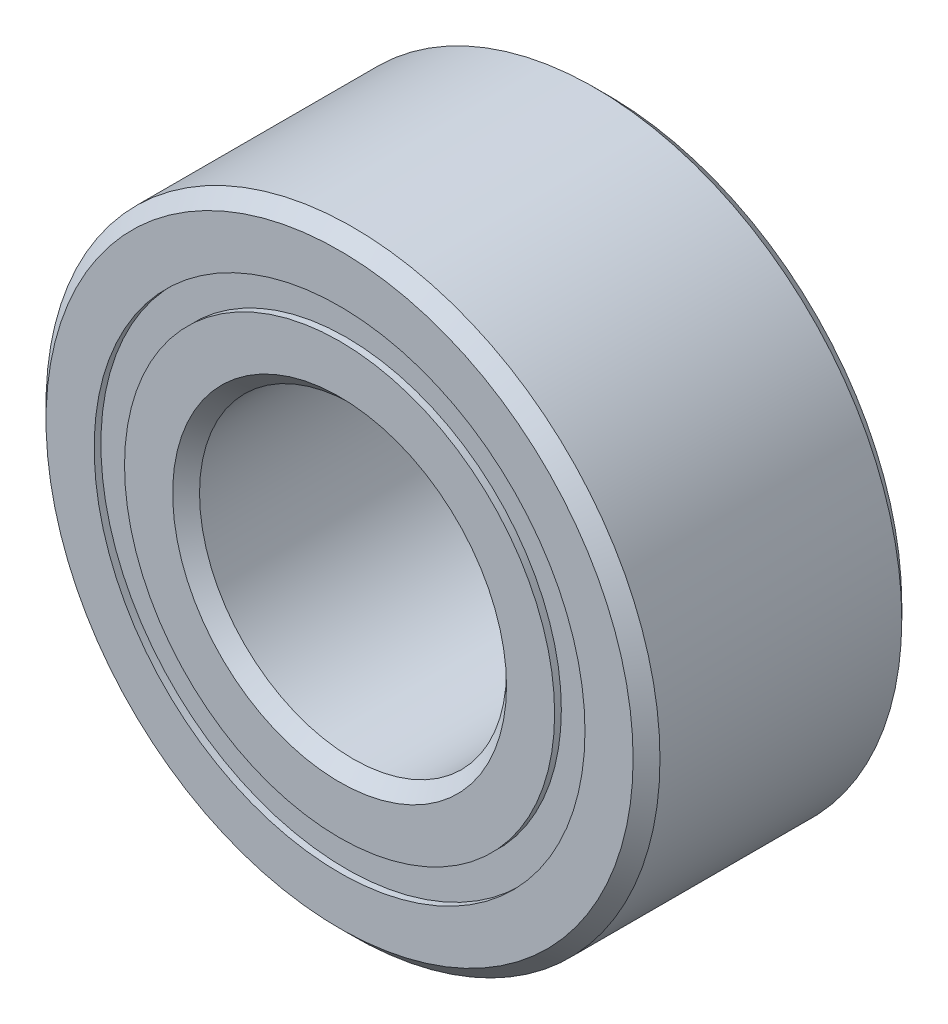
ISO-10303-21;
HEADER;
FILE_DESCRIPTION(('STEP AP214'),'2;1');
FILE_NAME('part.step','',(''),(''),'','','');
FILE_SCHEMA(('AUTOMOTIVE_DESIGN { 1 0 10303 214 1 1 1 1 }'));
ENDSEC;
DATA;
#1=APPLICATION_CONTEXT('core data for automotive mechanical design processes');
#2=APPLICATION_PROTOCOL_DEFINITION('international standard','automotive_design',2000,#1);
#3=PRODUCT_CONTEXT('',#1,'mechanical');
#4=PRODUCT('Part','Part','',(#3));
#5=PRODUCT_RELATED_PRODUCT_CATEGORY('part','',(#4));
#6=PRODUCT_DEFINITION_FORMATION('','',#4);
#7=PRODUCT_DEFINITION_CONTEXT('part definition',#1,'design');
#8=PRODUCT_DEFINITION('design','',#6,#7);
#9=PRODUCT_DEFINITION_SHAPE('','',#8);
#10=(LENGTH_UNIT() NAMED_UNIT(*) SI_UNIT(.MILLI.,.METRE.));
#11=(NAMED_UNIT(*) PLANE_ANGLE_UNIT() SI_UNIT($,.RADIAN.));
#12=(NAMED_UNIT(*) SI_UNIT($,.STERADIAN.) SOLID_ANGLE_UNIT());
#13=UNCERTAINTY_MEASURE_WITH_UNIT(LENGTH_MEASURE(1.E-05),#10,'distance_accuracy_value','');
#14=(GEOMETRIC_REPRESENTATION_CONTEXT(3) GLOBAL_UNCERTAINTY_ASSIGNED_CONTEXT((#13)) GLOBAL_UNIT_ASSIGNED_CONTEXT((#10,
#11,#12)) REPRESENTATION_CONTEXT('',''));
#15=CARTESIAN_POINT('',(0.,0.,0.));
#16=DIRECTION('',(0.,0.,1.));
#17=DIRECTION('',(1.,0.,0.));
#18=AXIS2_PLACEMENT_3D('',#15,#16,#17);
#19=CARTESIAN_POINT('',(0.,2.53822758241758,-1.319911));
#20=DIRECTION('',(0.,0.,1.));
#21=DIRECTION('',(1.,0.,0.));
#22=AXIS2_PLACEMENT_3D('',#19,#20,#21);
#23=PLANE('',#22);
#24=CARTESIAN_POINT('',(0.,0.,-1.319911));
#25=DIRECTION('',(0.,0.,1.));
#26=DIRECTION('',(1.,0.,0.));
#27=AXIS2_PLACEMENT_3D('',#24,#25,#26);
#28=CIRCLE('',#27,2.53822758241758);
#29=CARTESIAN_POINT('',(2.53822758241758,0.,-1.319911));
#30=VERTEX_POINT('',#29);
#31=EDGE_CURVE('E56',#30,#30,#28,.T.);
#32=ORIENTED_EDGE('',*,*,#31,.F.);
#33=EDGE_LOOP('',(#32));
#34=FACE_BOUND('',#33,.T.);
#35=CARTESIAN_POINT('',(0.,0.,-1.319911));
#36=DIRECTION('',(0.,0.,1.));
#37=DIRECTION('',(1.,0.,0.));
#38=AXIS2_PLACEMENT_3D('',#35,#36,#37);
#39=CIRCLE('',#38,2.22427241758242);
#40=CARTESIAN_POINT('',(2.22427241758242,0.,-1.319911));
#41=VERTEX_POINT('',#40);
#42=EDGE_CURVE('E11',#41,#41,#39,.T.);
#43=ORIENTED_EDGE('',*,*,#42,.T.);
#44=EDGE_LOOP('',(#43));
#45=FACE_BOUND('',#44,.T.);
#46=ADVANCED_FACE('F42',(#34,#45),#23,.F.);
#47=CARTESIAN_POINT('',(0.,0.,1.38938));
#48=DIRECTION('',(0.,0.,1.));
#49=DIRECTION('',(1.,0.,0.));
#50=AXIS2_PLACEMENT_3D('',#47,#48,#49);
#51=CYLINDRICAL_SURFACE('',#50,2.22427241758242);
#52=ORIENTED_EDGE('',*,*,#42,.F.);
#53=EDGE_LOOP('',(#52));
#54=FACE_BOUND('',#53,.T.);
#55=CARTESIAN_POINT('',(0.,0.,-0.63714280646575));
#56=DIRECTION('',(0.,0.,1.));
#57=DIRECTION('',(1.,0.,0.));
#58=AXIS2_PLACEMENT_3D('',#55,#56,#57);
#59=CIRCLE('',#58,2.22427241758242);
#60=CARTESIAN_POINT('',(2.22427241758242,0.,-0.63714280646575));
#61=VERTEX_POINT('',#60);
#62=EDGE_CURVE('E48',#61,#61,#59,.T.);
#63=ORIENTED_EDGE('',*,*,#62,.T.);
#64=EDGE_LOOP('',(#63));
#65=FACE_BOUND('',#64,.T.);
#66=ADVANCED_FACE('F65',(#54,#65),#51,.F.);
#67=CARTESIAN_POINT('',(0.,2.53822758241758,-0.63714280646575));
#68=DIRECTION('',(0.,0.,-1.));
#69=DIRECTION('',(-1.,0.,0.));
#70=AXIS2_PLACEMENT_3D('',#67,#68,#69);
#71=PLANE('',#70);
#72=ORIENTED_EDGE('',*,*,#62,.F.);
#73=EDGE_LOOP('',(#72));
#74=FACE_BOUND('',#73,.T.);
#75=CARTESIAN_POINT('',(0.,0.,-0.63714280646575));
#76=DIRECTION('',(0.,0.,1.));
#77=DIRECTION('',(1.,0.,0.));
#78=AXIS2_PLACEMENT_3D('',#75,#76,#77);
#79=CIRCLE('',#78,2.53822758241758);
#80=CARTESIAN_POINT('',(2.53822758241758,0.,-0.63714280646575));
#81=VERTEX_POINT('',#80);
#82=EDGE_CURVE('E52',#81,#81,#79,.T.);
#83=ORIENTED_EDGE('',*,*,#82,.T.);
#84=EDGE_LOOP('',(#83));
#85=FACE_BOUND('',#84,.T.);
#86=ADVANCED_FACE('F69',(#74,#85),#71,.F.);
#87=CARTESIAN_POINT('',(0.,0.,1.38938));
#88=DIRECTION('',(0.,0.,1.));
#89=DIRECTION('',(1.,0.,0.));
#90=AXIS2_PLACEMENT_3D('',#87,#88,#89);
#91=CYLINDRICAL_SURFACE('',#90,2.53822758241758);
#92=ORIENTED_EDGE('',*,*,#82,.F.);
#93=EDGE_LOOP('',(#92));
#94=FACE_BOUND('',#93,.T.);
#95=ORIENTED_EDGE('',*,*,#31,.T.);
#96=EDGE_LOOP('',(#95));
#97=FACE_BOUND('',#96,.T.);
#98=ADVANCED_FACE('F62',(#94,#97),#91,.T.);
#99=CLOSED_SHELL('',(#46,#66,#86,#98));
#100=MANIFOLD_SOLID_BREP('B2',#99);
#101=CARTESIAN_POINT('',(0.,2.53822758241758,1.319911));
#102=DIRECTION('',(0.,0.,-1.));
#103=DIRECTION('',(-1.,0.,0.));
#104=AXIS2_PLACEMENT_3D('',#101,#102,#103);
#105=PLANE('',#104);
#106=CARTESIAN_POINT('',(0.,0.,1.319911));
#107=DIRECTION('',(0.,0.,1.));
#108=DIRECTION('',(1.,0.,0.));
#109=AXIS2_PLACEMENT_3D('',#106,#107,#108);
#110=CIRCLE('',#109,2.22427241758242);
#111=CARTESIAN_POINT('',(2.22427241758242,0.,1.319911));
#112=VERTEX_POINT('',#111);
#113=EDGE_CURVE('E41',#112,#112,#110,.T.);
#114=ORIENTED_EDGE('',*,*,#113,.F.);
#115=EDGE_LOOP('',(#114));
#116=FACE_BOUND('',#115,.T.);
#117=CARTESIAN_POINT('',(0.,0.,1.319911));
#118=DIRECTION('',(0.,0.,1.));
#119=DIRECTION('',(1.,0.,0.));
#120=AXIS2_PLACEMENT_3D('',#117,#118,#119);
#121=CIRCLE('',#120,2.53822758241758);
#122=CARTESIAN_POINT('',(2.53822758241758,0.,1.319911));
#123=VERTEX_POINT('',#122);
#124=EDGE_CURVE('E124',#123,#123,#121,.T.);
#125=ORIENTED_EDGE('',*,*,#124,.T.);
#126=EDGE_LOOP('',(#125));
#127=FACE_BOUND('',#126,.T.);
#128=ADVANCED_FACE('F110',(#116,#127),#105,.F.);
#129=CARTESIAN_POINT('',(0.,0.,1.38938));
#130=DIRECTION('',(0.,0.,1.));
#131=DIRECTION('',(1.,0.,0.));
#132=AXIS2_PLACEMENT_3D('',#129,#130,#131);
#133=CYLINDRICAL_SURFACE('',#132,2.22427241758242);
#134=CARTESIAN_POINT('',(0.,0.,0.637142806465749));
#135=DIRECTION('',(0.,0.,1.));
#136=DIRECTION('',(1.,0.,0.));
#137=AXIS2_PLACEMENT_3D('',#134,#135,#136);
#138=CIRCLE('',#137,2.22427241758242);
#139=CARTESIAN_POINT('',(2.22427241758242,0.,0.637142806465749));
#140=VERTEX_POINT('',#139);
#141=EDGE_CURVE('E116',#140,#140,#138,.T.);
#142=ORIENTED_EDGE('',*,*,#141,.F.);
#143=EDGE_LOOP('',(#142));
#144=FACE_BOUND('',#143,.T.);
#145=ORIENTED_EDGE('',*,*,#113,.T.);
#146=EDGE_LOOP('',(#145));
#147=FACE_BOUND('',#146,.T.);
#148=ADVANCED_FACE('F139',(#144,#147),#133,.F.);
#149=CARTESIAN_POINT('',(0.,2.53822758241758,0.637142806465749));
#150=DIRECTION('',(0.,0.,1.));
#151=DIRECTION('',(1.,0.,0.));
#152=AXIS2_PLACEMENT_3D('',#149,#150,#151);
#153=PLANE('',#152);
#154=CARTESIAN_POINT('',(0.,0.,0.637142806465749));
#155=DIRECTION('',(0.,0.,1.));
#156=DIRECTION('',(1.,0.,0.));
#157=AXIS2_PLACEMENT_3D('',#154,#155,#156);
#158=CIRCLE('',#157,2.53822758241758);
#159=CARTESIAN_POINT('',(2.53822758241758,0.,0.637142806465749));
#160=VERTEX_POINT('',#159);
#161=EDGE_CURVE('E120',#160,#160,#158,.T.);
#162=ORIENTED_EDGE('',*,*,#161,.F.);
#163=EDGE_LOOP('',(#162));
#164=FACE_BOUND('',#163,.T.);
#165=ORIENTED_EDGE('',*,*,#141,.T.);
#166=EDGE_LOOP('',(#165));
#167=FACE_BOUND('',#166,.T.);
#168=ADVANCED_FACE('F134',(#164,#167),#153,.F.);
#169=CARTESIAN_POINT('',(0.,0.,1.38938));
#170=DIRECTION('',(0.,0.,1.));
#171=DIRECTION('',(1.,0.,0.));
#172=AXIS2_PLACEMENT_3D('',#169,#170,#171);
#173=CYLINDRICAL_SURFACE('',#172,2.53822758241758);
#174=ORIENTED_EDGE('',*,*,#124,.F.);
#175=EDGE_LOOP('',(#174));
#176=FACE_BOUND('',#175,.T.);
#177=ORIENTED_EDGE('',*,*,#161,.T.);
#178=EDGE_LOOP('',(#177));
#179=FACE_BOUND('',#178,.T.);
#180=ADVANCED_FACE('F131',(#176,#179),#173,.T.);
#181=CLOSED_SHELL('',(#128,#148,#168,#180));
#182=MANIFOLD_SOLID_BREP('B6',#181);
#183=CARTESIAN_POINT('',(-1.39966363202143,1.92647171785536,0.));
#184=DIRECTION('',(0.,0.,1.));
#185=DIRECTION('',(0.587785252292462,-0.809016994374955,0.));
#186=AXIS2_PLACEMENT_3D('',#183,#184,#185);
#187=SPHERICAL_SURFACE('',#186,0.63714280646575);
#188=CARTESIAN_POINT('',(-1.39966363202143,1.92647171785536,0.637142806465749));
#189=VERTEX_POINT('',#188);
#190=VERTEX_LOOP('',#189);
#191=FACE_BOUND('',#190,.T.);
#192=ADVANCED_FACE('F177',(#191),#187,.T.);
#193=CLOSED_SHELL('',(#192));
#194=MANIFOLD_SOLID_BREP('B36',#193);
#195=CARTESIAN_POINT('',(-2.26470332942783,0.735846717855369,0.));
#196=DIRECTION('',(0.,0.,1.));
#197=DIRECTION('',(0.95105651629515,-0.309016994374958,0.));
#198=AXIS2_PLACEMENT_3D('',#195,#196,#197);
#199=SPHERICAL_SURFACE('',#198,0.63714280646575);
#200=CARTESIAN_POINT('',(-2.26470332942783,0.735846717855369,0.637142806465749));
#201=VERTEX_POINT('',#200);
#202=VERTEX_LOOP('',#201);
#203=FACE_BOUND('',#202,.T.);
#204=ADVANCED_FACE('F197',(#203),#199,.T.);
#205=CLOSED_SHELL('',(#204));
#206=MANIFOLD_SOLID_BREP('B106',#205);
#207=CARTESIAN_POINT('',(-2.26470332942784,-0.735846717855322,0.));
#208=DIRECTION('',(0.,0.,1.));
#209=DIRECTION('',(0.951056516295157,0.309016994374938,0.));
#210=AXIS2_PLACEMENT_3D('',#207,#208,#209);
#211=SPHERICAL_SURFACE('',#210,0.63714280646575);
#212=CARTESIAN_POINT('',(-2.26470332942784,-0.735846717855322,0.637142806465749));
#213=VERTEX_POINT('',#212);
#214=VERTEX_LOOP('',#213);
#215=FACE_BOUND('',#214,.T.);
#216=ADVANCED_FACE('F217',(#215),#211,.T.);
#217=CLOSED_SHELL('',(#216));
#218=MANIFOLD_SOLID_BREP('B173',#217);
#219=CARTESIAN_POINT('',(-1.39966363202147,-1.92647171785533,0.));
#220=DIRECTION('',(0.,0.,1.));
#221=DIRECTION('',(0.58778525229248,0.809016994374942,0.));
#222=AXIS2_PLACEMENT_3D('',#219,#220,#221);
#223=SPHERICAL_SURFACE('',#222,0.63714280646575);
#224=CARTESIAN_POINT('',(-1.39966363202147,-1.92647171785533,0.637142806465749));
#225=VERTEX_POINT('',#224);
#226=VERTEX_LOOP('',#225);
#227=FACE_BOUND('',#226,.T.);
#228=ADVANCED_FACE('F237',(#227),#223,.T.);
#229=CLOSED_SHELL('',(#228));
#230=MANIFOLD_SOLID_BREP('B193',#229);
#231=CARTESIAN_POINT('',(0.,-2.38125,0.));
#232=DIRECTION('',(0.,0.,1.));
#233=DIRECTION('',(0.,1.,0.));
#234=AXIS2_PLACEMENT_3D('',#231,#232,#233);
#235=SPHERICAL_SURFACE('',#234,0.63714280646575);
#236=CARTESIAN_POINT('',(0.,-2.38125,0.637142806465749));
#237=VERTEX_POINT('',#236);
#238=VERTEX_LOOP('',#237);
#239=FACE_BOUND('',#238,.T.);
#240=ADVANCED_FACE('F257',(#239),#235,.T.);
#241=CLOSED_SHELL('',(#240));
#242=MANIFOLD_SOLID_BREP('B213',#241);
#243=CARTESIAN_POINT('',(1.39966363202144,-1.92647171785535,0.));
#244=DIRECTION('',(0.,0.,1.));
#245=DIRECTION('',(-0.587785252292469,0.809016994374951,0.));
#246=AXIS2_PLACEMENT_3D('',#243,#244,#245);
#247=SPHERICAL_SURFACE('',#246,0.63714280646575);
#248=CARTESIAN_POINT('',(1.39966363202144,-1.92647171785535,0.637142806465749));
#249=VERTEX_POINT('',#248);
#250=VERTEX_LOOP('',#249);
#251=FACE_BOUND('',#250,.T.);
#252=ADVANCED_FACE('F277',(#251),#247,.T.);
#253=CLOSED_SHELL('',(#252));
#254=MANIFOLD_SOLID_BREP('B233',#253);
#255=CARTESIAN_POINT('',(2.26470332942783,-0.735846717855354,0.));
#256=DIRECTION('',(0.,0.,1.));
#257=DIRECTION('',(-0.951056516295152,0.309016994374952,0.));
#258=AXIS2_PLACEMENT_3D('',#255,#256,#257);
#259=SPHERICAL_SURFACE('',#258,0.63714280646575);
#260=CARTESIAN_POINT('',(2.26470332942783,-0.735846717855354,0.637142806465749));
#261=VERTEX_POINT('',#260);
#262=VERTEX_LOOP('',#261);
#263=FACE_BOUND('',#262,.T.);
#264=ADVANCED_FACE('F297',(#263),#259,.T.);
#265=CLOSED_SHELL('',(#264));
#266=MANIFOLD_SOLID_BREP('B253',#265);
#267=CARTESIAN_POINT('',(2.26470332942784,0.735846717855337,0.));
#268=DIRECTION('',(0.,0.,1.));
#269=DIRECTION('',(-0.951056516295155,-0.309016994374945,0.));
#270=AXIS2_PLACEMENT_3D('',#267,#268,#269);
#271=SPHERICAL_SURFACE('',#270,0.63714280646575);
#272=CARTESIAN_POINT('',(2.26470332942784,0.735846717855337,0.637142806465749));
#273=VERTEX_POINT('',#272);
#274=VERTEX_LOOP('',#273);
#275=FACE_BOUND('',#274,.T.);
#276=ADVANCED_FACE('F317',(#275),#271,.T.);
#277=CLOSED_SHELL('',(#276));
#278=MANIFOLD_SOLID_BREP('B273',#277);
#279=CARTESIAN_POINT('',(1.39966363202145,1.92647171785534,0.));
#280=DIRECTION('',(0.,0.,1.));
#281=DIRECTION('',(-0.587785252292474,-0.809016994374947,0.));
#282=AXIS2_PLACEMENT_3D('',#279,#280,#281);
#283=SPHERICAL_SURFACE('',#282,0.63714280646575);
#284=CARTESIAN_POINT('',(1.39966363202145,1.92647171785534,0.637142806465749));
#285=VERTEX_POINT('',#284);
#286=VERTEX_LOOP('',#285);
#287=FACE_BOUND('',#286,.T.);
#288=ADVANCED_FACE('F337',(#287),#283,.T.);
#289=CLOSED_SHELL('',(#288));
#290=MANIFOLD_SOLID_BREP('B293',#289);
#291=CARTESIAN_POINT('',(0.,2.38125,0.));
#292=DIRECTION('',(0.,0.,1.));
#293=DIRECTION('',(0.,-1.,0.));
#294=AXIS2_PLACEMENT_3D('',#291,#292,#293);
#295=SPHERICAL_SURFACE('',#294,0.63714280646575);
#296=CARTESIAN_POINT('',(0.,2.38125,0.637142806465749));
#297=VERTEX_POINT('',#296);
#298=VERTEX_LOOP('',#297);
#299=FACE_BOUND('',#298,.T.);
#300=ADVANCED_FACE('F360',(#299),#295,.T.);
#301=CLOSED_SHELL('',(#300));
#302=MANIFOLD_SOLID_BREP('B313',#301);
#303=CARTESIAN_POINT('',(0.,2.22427241758242,1.38938));
#304=DIRECTION('',(0.,0.,-1.));
#305=DIRECTION('',(-1.,0.,0.));
#306=AXIS2_PLACEMENT_3D('',#303,#304,#305);
#307=PLANE('',#306);
#308=CARTESIAN_POINT('',(0.,0.,1.38938));
#309=DIRECTION('',(0.,0.,1.));
#310=DIRECTION('',(1.,0.,0.));
#311=AXIS2_PLACEMENT_3D('',#308,#309,#310);
#312=CIRCLE('',#311,1.726438);
#313=CARTESIAN_POINT('',(1.726438,0.,1.38938));
#314=VERTEX_POINT('',#313);
#315=EDGE_CURVE('E408',#314,#314,#312,.T.);
#316=ORIENTED_EDGE('',*,*,#315,.F.);
#317=EDGE_LOOP('',(#316));
#318=FACE_BOUND('',#317,.T.);
#319=CARTESIAN_POINT('',(0.,0.,1.38938));
#320=DIRECTION('',(0.,0.,1.));
#321=DIRECTION('',(1.,0.,0.));
#322=AXIS2_PLACEMENT_3D('',#319,#320,#321);
#323=CIRCLE('',#322,2.22427241758242);
#324=CARTESIAN_POINT('',(2.22427241758242,0.,1.38938));
#325=VERTEX_POINT('',#324);
#326=EDGE_CURVE('E359',#325,#325,#323,.T.);
#327=ORIENTED_EDGE('',*,*,#326,.T.);
#328=EDGE_LOOP('',(#327));
#329=FACE_BOUND('',#328,.T.);
#330=ADVANCED_FACE('F380',(#318,#329),#307,.F.);
#331=CARTESIAN_POINT('',(0.,0.,1.38938));
#332=DIRECTION('',(0.,0.,1.));
#333=DIRECTION('',(1.,0.,0.));
#334=AXIS2_PLACEMENT_3D('',#331,#332,#333);
#335=CYLINDRICAL_SURFACE('',#334,2.22427241758242);
#336=ORIENTED_EDGE('',*,*,#326,.F.);
#337=EDGE_LOOP('',(#336));
#338=FACE_BOUND('',#337,.T.);
#339=CARTESIAN_POINT('',(0.,0.,0.617502222222223));
#340=DIRECTION('',(0.,0.,1.));
#341=DIRECTION('',(1.,0.,0.));
#342=AXIS2_PLACEMENT_3D('',#339,#340,#341);
#343=CIRCLE('',#342,2.22427241758242);
#344=CARTESIAN_POINT('',(2.22427241758242,0.,0.617502222222223));
#345=VERTEX_POINT('',#344);
#346=EDGE_CURVE('E386',#345,#345,#343,.T.);
#347=ORIENTED_EDGE('',*,*,#346,.T.);
#348=EDGE_LOOP('',(#347));
#349=FACE_BOUND('',#348,.T.);
#350=ADVANCED_FACE('F415',(#338,#349),#335,.T.);
#351=CARTESIAN_POINT('',(0.,0.,0.));
#352=DIRECTION('',(0.,0.,1.));
#353=DIRECTION('',(1.,0.,0.));
#354=AXIS2_PLACEMENT_3D('',#351,#352,#353);
#355=TOROIDAL_SURFACE('',#354,2.38124999999999,0.637142806465748);
#356=ORIENTED_EDGE('',*,*,#346,.F.);
#357=EDGE_LOOP('',(#356));
#358=FACE_BOUND('',#357,.T.);
#359=CARTESIAN_POINT('',(0.,0.,-0.617502222222224));
#360=DIRECTION('',(0.,0.,1.));
#361=DIRECTION('',(1.,0.,0.));
#362=AXIS2_PLACEMENT_3D('',#359,#360,#361);
#363=CIRCLE('',#362,2.22427241758242);
#364=CARTESIAN_POINT('',(2.22427241758242,0.,-0.617502222222224));
#365=VERTEX_POINT('',#364);
#366=EDGE_CURVE('E390',#365,#365,#363,.T.);
#367=ORIENTED_EDGE('',*,*,#366,.T.);
#368=EDGE_LOOP('',(#367));
#369=FACE_BOUND('',#368,.T.);
#370=ADVANCED_FACE('F419',(#358,#369),#355,.F.);
#371=CARTESIAN_POINT('',(0.,0.,1.38938));
#372=DIRECTION('',(0.,0.,1.));
#373=DIRECTION('',(1.,0.,0.));
#374=AXIS2_PLACEMENT_3D('',#371,#372,#373);
#375=CYLINDRICAL_SURFACE('',#374,2.22427241758242);
#376=ORIENTED_EDGE('',*,*,#366,.F.);
#377=EDGE_LOOP('',(#376));
#378=FACE_BOUND('',#377,.T.);
#379=CARTESIAN_POINT('',(0.,0.,-1.38938));
#380=DIRECTION('',(0.,0.,1.));
#381=DIRECTION('',(1.,0.,0.));
#382=AXIS2_PLACEMENT_3D('',#379,#380,#381);
#383=CIRCLE('',#382,2.22427241758242);
#384=CARTESIAN_POINT('',(2.22427241758242,0.,-1.38938));
#385=VERTEX_POINT('',#384);
#386=EDGE_CURVE('E394',#385,#385,#383,.T.);
#387=ORIENTED_EDGE('',*,*,#386,.T.);
#388=EDGE_LOOP('',(#387));
#389=FACE_BOUND('',#388,.T.);
#390=ADVANCED_FACE('F424',(#378,#389),#375,.T.);
#391=CARTESIAN_POINT('',(0.,1.726438,-1.38938));
#392=DIRECTION('',(0.,0.,1.));
#393=DIRECTION('',(1.,0.,0.));
#394=AXIS2_PLACEMENT_3D('',#391,#392,#393);
#395=PLANE('',#394);
#396=ORIENTED_EDGE('',*,*,#386,.F.);
#397=EDGE_LOOP('',(#396));
#398=FACE_BOUND('',#397,.T.);
#399=CARTESIAN_POINT('',(0.,0.,-1.38938));
#400=DIRECTION('',(0.,0.,1.));
#401=DIRECTION('',(1.,0.,0.));
#402=AXIS2_PLACEMENT_3D('',#399,#400,#401);
#403=CIRCLE('',#402,1.726438);
#404=CARTESIAN_POINT('',(1.726438,0.,-1.38938));
#405=VERTEX_POINT('',#404);
#406=EDGE_CURVE('E399',#405,#405,#403,.T.);
#407=ORIENTED_EDGE('',*,*,#406,.T.);
#408=EDGE_LOOP('',(#407));
#409=FACE_BOUND('',#408,.T.);
#410=ADVANCED_FACE('F430',(#398,#409),#395,.F.);
#411=CARTESIAN_POINT('',(0.,0.,-1.250442));
#412=DIRECTION('',(0.,0.,-1.));
#413=DIRECTION('',(-1.,0.,0.));
#414=AXIS2_PLACEMENT_3D('',#411,#412,#413);
#415=CONICAL_SURFACE('',#414,1.5875,0.785398163397447);
#416=ORIENTED_EDGE('',*,*,#406,.F.);
#417=EDGE_LOOP('',(#416));
#418=FACE_BOUND('',#417,.T.);
#419=CARTESIAN_POINT('',(0.,0.,-1.250442));
#420=DIRECTION('',(0.,0.,1.));
#421=DIRECTION('',(1.,0.,0.));
#422=AXIS2_PLACEMENT_3D('',#419,#420,#421);
#423=CIRCLE('',#422,1.5875);
#424=CARTESIAN_POINT('',(1.5875,0.,-1.250442));
#425=VERTEX_POINT('',#424);
#426=EDGE_CURVE('E402',#425,#425,#423,.T.);
#427=ORIENTED_EDGE('',*,*,#426,.T.);
#428=EDGE_LOOP('',(#427));
#429=FACE_BOUND('',#428,.T.);
#430=ADVANCED_FACE('F434',(#418,#429),#415,.F.);
#431=CARTESIAN_POINT('',(0.,0.,1.38938));
#432=DIRECTION('',(0.,0.,1.));
#433=DIRECTION('',(1.,0.,0.));
#434=AXIS2_PLACEMENT_3D('',#431,#432,#433);
#435=CYLINDRICAL_SURFACE('',#434,1.5875);
#436=ORIENTED_EDGE('',*,*,#426,.F.);
#437=EDGE_LOOP('',(#436));
#438=FACE_BOUND('',#437,.T.);
#439=CARTESIAN_POINT('',(0.,0.,1.250442));
#440=DIRECTION('',(0.,0.,1.));
#441=DIRECTION('',(1.,0.,0.));
#442=AXIS2_PLACEMENT_3D('',#439,#440,#441);
#443=CIRCLE('',#442,1.5875);
#444=CARTESIAN_POINT('',(1.5875,0.,1.250442));
#445=VERTEX_POINT('',#444);
#446=EDGE_CURVE('E405',#445,#445,#443,.T.);
#447=ORIENTED_EDGE('',*,*,#446,.T.);
#448=EDGE_LOOP('',(#447));
#449=FACE_BOUND('',#448,.T.);
#450=ADVANCED_FACE('F438',(#438,#449),#435,.F.);
#451=CARTESIAN_POINT('',(0.,0.,1.38938));
#452=DIRECTION('',(0.,0.,1.));
#453=DIRECTION('',(1.,0.,0.));
#454=AXIS2_PLACEMENT_3D('',#451,#452,#453);
#455=CONICAL_SURFACE('',#454,1.726438,0.785398163397451);
#456=ORIENTED_EDGE('',*,*,#446,.F.);
#457=EDGE_LOOP('',(#456));
#458=FACE_BOUND('',#457,.T.);
#459=ORIENTED_EDGE('',*,*,#315,.T.);
#460=EDGE_LOOP('',(#459));
#461=FACE_BOUND('',#460,.T.);
#462=ADVANCED_FACE('F412',(#458,#461),#455,.F.);
#463=CLOSED_SHELL('',(#330,#350,#370,#390,#410,#430,#450,#462));
#464=MANIFOLD_SOLID_BREP('B333',#463);
#465=CARTESIAN_POINT('',(0.,0.,1.250442));
#466=DIRECTION('',(0.,0.,-1.));
#467=DIRECTION('',(-1.,0.,0.));
#468=AXIS2_PLACEMENT_3D('',#465,#466,#467);
#469=CONICAL_SURFACE('',#468,3.175,0.785398163397449);
#470=CARTESIAN_POINT('',(0.,0.,1.38938));
#471=DIRECTION('',(0.,0.,1.));
#472=DIRECTION('',(1.,0.,0.));
#473=AXIS2_PLACEMENT_3D('',#470,#471,#472);
#474=CIRCLE('',#473,3.036062);
#475=CARTESIAN_POINT('',(3.036062,0.,1.38938));
#476=VERTEX_POINT('',#475);
#477=EDGE_CURVE('E530',#476,#476,#474,.T.);
#478=ORIENTED_EDGE('',*,*,#477,.F.);
#479=EDGE_LOOP('',(#478));
#480=FACE_BOUND('',#479,.T.);
#481=CARTESIAN_POINT('',(0.,0.,1.250442));
#482=DIRECTION('',(0.,0.,1.));
#483=DIRECTION('',(1.,0.,0.));
#484=AXIS2_PLACEMENT_3D('',#481,#482,#483);
#485=CIRCLE('',#484,3.175);
#486=CARTESIAN_POINT('',(3.175,0.,1.250442));
#487=VERTEX_POINT('',#486);
#488=EDGE_CURVE('E379',#487,#487,#485,.T.);
#489=ORIENTED_EDGE('',*,*,#488,.T.);
#490=EDGE_LOOP('',(#489));
#491=FACE_BOUND('',#490,.T.);
#492=ADVANCED_FACE('F502',(#480,#491),#469,.T.);
#493=CARTESIAN_POINT('',(0.,0.,1.38938));
#494=DIRECTION('',(0.,0.,1.));
#495=DIRECTION('',(1.,0.,0.));
#496=AXIS2_PLACEMENT_3D('',#493,#494,#495);
#497=CYLINDRICAL_SURFACE('',#496,3.175);
#498=ORIENTED_EDGE('',*,*,#488,.F.);
#499=EDGE_LOOP('',(#498));
#500=FACE_BOUND('',#499,.T.);
#501=CARTESIAN_POINT('',(0.,0.,-1.250442));
#502=DIRECTION('',(0.,0.,1.));
#503=DIRECTION('',(1.,0.,0.));
#504=AXIS2_PLACEMENT_3D('',#501,#502,#503);
#505=CIRCLE('',#504,3.175);
#506=CARTESIAN_POINT('',(3.175,0.,-1.250442));
#507=VERTEX_POINT('',#506);
#508=EDGE_CURVE('E508',#507,#507,#505,.T.);
#509=ORIENTED_EDGE('',*,*,#508,.T.);
#510=EDGE_LOOP('',(#509));
#511=FACE_BOUND('',#510,.T.);
#512=ADVANCED_FACE('F537',(#500,#511),#497,.T.);
#513=CARTESIAN_POINT('',(0.,0.,-1.38938));
#514=DIRECTION('',(0.,0.,1.));
#515=DIRECTION('',(1.,0.,0.));
#516=AXIS2_PLACEMENT_3D('',#513,#514,#515);
#517=CONICAL_SURFACE('',#516,3.036062,0.785398163397445);
#518=ORIENTED_EDGE('',*,*,#508,.F.);
#519=EDGE_LOOP('',(#518));
#520=FACE_BOUND('',#519,.T.);
#521=CARTESIAN_POINT('',(0.,0.,-1.38938));
#522=DIRECTION('',(0.,0.,1.));
#523=DIRECTION('',(1.,0.,0.));
#524=AXIS2_PLACEMENT_3D('',#521,#522,#523);
#525=CIRCLE('',#524,3.036062);
#526=CARTESIAN_POINT('',(3.036062,0.,-1.38938));
#527=VERTEX_POINT('',#526);
#528=EDGE_CURVE('E512',#527,#527,#525,.T.);
#529=ORIENTED_EDGE('',*,*,#528,.T.);
#530=EDGE_LOOP('',(#529));
#531=FACE_BOUND('',#530,.T.);
#532=ADVANCED_FACE('F541',(#520,#531),#517,.T.);
#533=CARTESIAN_POINT('',(0.,3.036062,-1.38938));
#534=DIRECTION('',(0.,0.,1.));
#535=DIRECTION('',(1.,0.,0.));
#536=AXIS2_PLACEMENT_3D('',#533,#534,#535);
#537=PLANE('',#536);
#538=ORIENTED_EDGE('',*,*,#528,.F.);
#539=EDGE_LOOP('',(#538));
#540=FACE_BOUND('',#539,.T.);
#541=CARTESIAN_POINT('',(0.,0.,-1.38938));
#542=DIRECTION('',(0.,0.,1.));
#543=DIRECTION('',(1.,0.,0.));
#544=AXIS2_PLACEMENT_3D('',#541,#542,#543);
#545=CIRCLE('',#544,2.53822758241758);
#546=CARTESIAN_POINT('',(2.53822758241758,0.,-1.38938));
#547=VERTEX_POINT('',#546);
#548=EDGE_CURVE('E516',#547,#547,#545,.T.);
#549=ORIENTED_EDGE('',*,*,#548,.T.);
#550=EDGE_LOOP('',(#549));
#551=FACE_BOUND('',#550,.T.);
#552=ADVANCED_FACE('F546',(#540,#551),#537,.F.);
#553=CARTESIAN_POINT('',(0.,0.,1.38938));
#554=DIRECTION('',(0.,0.,1.));
#555=DIRECTION('',(1.,0.,0.));
#556=AXIS2_PLACEMENT_3D('',#553,#554,#555);
#557=CYLINDRICAL_SURFACE('',#556,2.53822758241758);
#558=ORIENTED_EDGE('',*,*,#548,.F.);
#559=EDGE_LOOP('',(#558));
#560=FACE_BOUND('',#559,.T.);
#561=CARTESIAN_POINT('',(0.,0.,-0.617502222222223));
#562=DIRECTION('',(0.,0.,1.));
#563=DIRECTION('',(1.,0.,0.));
#564=AXIS2_PLACEMENT_3D('',#561,#562,#563);
#565=CIRCLE('',#564,2.53822758241758);
#566=CARTESIAN_POINT('',(2.53822758241758,0.,-0.617502222222223));
#567=VERTEX_POINT('',#566);
#568=EDGE_CURVE('E521',#567,#567,#565,.T.);
#569=ORIENTED_EDGE('',*,*,#568,.T.);
#570=EDGE_LOOP('',(#569));
#571=FACE_BOUND('',#570,.T.);
#572=ADVANCED_FACE('F552',(#560,#571),#557,.F.);
#573=CARTESIAN_POINT('',(0.,0.,0.));
#574=DIRECTION('',(0.,0.,1.));
#575=DIRECTION('',(1.,0.,0.));
#576=AXIS2_PLACEMENT_3D('',#573,#574,#575);
#577=TOROIDAL_SURFACE('',#576,2.38125,0.63714280646575);
#578=ORIENTED_EDGE('',*,*,#568,.F.);
#579=EDGE_LOOP('',(#578));
#580=FACE_BOUND('',#579,.T.);
#581=CARTESIAN_POINT('',(0.,0.,0.617502222222222));
#582=DIRECTION('',(0.,0.,1.));
#583=DIRECTION('',(1.,0.,0.));
#584=AXIS2_PLACEMENT_3D('',#581,#582,#583);
#585=CIRCLE('',#584,2.53822758241758);
#586=CARTESIAN_POINT('',(2.53822758241758,0.,0.617502222222222));
#587=VERTEX_POINT('',#586);
#588=EDGE_CURVE('E524',#587,#587,#585,.T.);
#589=ORIENTED_EDGE('',*,*,#588,.T.);
#590=EDGE_LOOP('',(#589));
#591=FACE_BOUND('',#590,.T.);
#592=ADVANCED_FACE('F556',(#580,#591),#577,.F.);
#593=CARTESIAN_POINT('',(0.,0.,1.38938));
#594=DIRECTION('',(0.,0.,1.));
#595=DIRECTION('',(1.,0.,0.));
#596=AXIS2_PLACEMENT_3D('',#593,#594,#595);
#597=CYLINDRICAL_SURFACE('',#596,2.53822758241758);
#598=ORIENTED_EDGE('',*,*,#588,.F.);
#599=EDGE_LOOP('',(#598));
#600=FACE_BOUND('',#599,.T.);
#601=CARTESIAN_POINT('',(0.,0.,1.38938));
#602=DIRECTION('',(0.,0.,1.));
#603=DIRECTION('',(1.,0.,0.));
#604=AXIS2_PLACEMENT_3D('',#601,#602,#603);
#605=CIRCLE('',#604,2.53822758241758);
#606=CARTESIAN_POINT('',(2.53822758241758,0.,1.38938));
#607=VERTEX_POINT('',#606);
#608=EDGE_CURVE('E527',#607,#607,#605,.T.);
#609=ORIENTED_EDGE('',*,*,#608,.T.);
#610=EDGE_LOOP('',(#609));
#611=FACE_BOUND('',#610,.T.);
#612=ADVANCED_FACE('F560',(#600,#611),#597,.F.);
#613=CARTESIAN_POINT('',(0.,3.036062,1.38938));
#614=DIRECTION('',(0.,0.,-1.));
#615=DIRECTION('',(-1.,0.,0.));
#616=AXIS2_PLACEMENT_3D('',#613,#614,#615);
#617=PLANE('',#616);
#618=ORIENTED_EDGE('',*,*,#608,.F.);
#619=EDGE_LOOP('',(#618));
#620=FACE_BOUND('',#619,.T.);
#621=ORIENTED_EDGE('',*,*,#477,.T.);
#622=EDGE_LOOP('',(#621));
#623=FACE_BOUND('',#622,.T.);
#624=ADVANCED_FACE('F534',(#620,#623),#617,.F.);
#625=CLOSED_SHELL('',(#492,#512,#532,#552,#572,#592,#612,#624));
#626=MANIFOLD_SOLID_BREP('B354',#625);
#627=ADVANCED_BREP_SHAPE_REPRESENTATION('',(#18,#100,#182,#194,#206,#218,#230,#242,#254,#266,
#278,#290,#302,#464,#626),#14);
#628=SHAPE_DEFINITION_REPRESENTATION(#9,#627);
ENDSEC;
END-ISO-10303-21;
